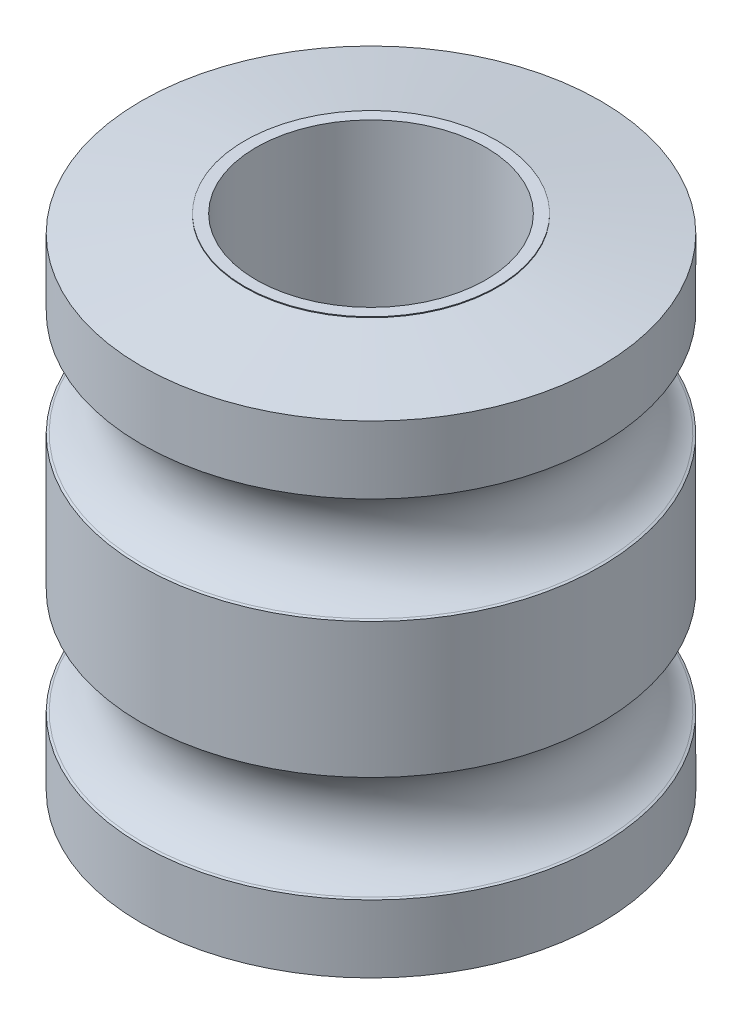
ISO-10303-21;
HEADER;
FILE_DESCRIPTION(('STEP AP214'),'2;1');
FILE_NAME('part.step','',(''),(''),'','','');
FILE_SCHEMA(('AUTOMOTIVE_DESIGN { 1 0 10303 214 1 1 1 1 }'));
ENDSEC;
DATA;
#1=APPLICATION_CONTEXT('core data for automotive mechanical design processes');
#2=APPLICATION_PROTOCOL_DEFINITION('international standard','automotive_design',2000,#1);
#3=PRODUCT_CONTEXT('',#1,'mechanical');
#4=PRODUCT('Part','Part','',(#3));
#5=PRODUCT_RELATED_PRODUCT_CATEGORY('part','',(#4));
#6=PRODUCT_DEFINITION_FORMATION('','',#4);
#7=PRODUCT_DEFINITION_CONTEXT('part definition',#1,'design');
#8=PRODUCT_DEFINITION('design','',#6,#7);
#9=PRODUCT_DEFINITION_SHAPE('','',#8);
#10=(LENGTH_UNIT() NAMED_UNIT(*) SI_UNIT(.MILLI.,.METRE.));
#11=(NAMED_UNIT(*) PLANE_ANGLE_UNIT() SI_UNIT($,.RADIAN.));
#12=(NAMED_UNIT(*) SI_UNIT($,.STERADIAN.) SOLID_ANGLE_UNIT());
#13=UNCERTAINTY_MEASURE_WITH_UNIT(LENGTH_MEASURE(1.E-05),#10,'distance_accuracy_value','');
#14=(GEOMETRIC_REPRESENTATION_CONTEXT(3) GLOBAL_UNCERTAINTY_ASSIGNED_CONTEXT((#13)) GLOBAL_UNIT_ASSIGNED_CONTEXT((#10,
#11,#12)) REPRESENTATION_CONTEXT('',''));
#15=CARTESIAN_POINT('',(0.,0.,0.));
#16=DIRECTION('',(0.,0.,1.));
#17=DIRECTION('',(1.,0.,0.));
#18=AXIS2_PLACEMENT_3D('',#15,#16,#17);
#19=CARTESIAN_POINT('',(0.,2.667,0.));
#20=DIRECTION('',(0.,-1.,0.));
#21=DIRECTION('',(0.,0.,-1.));
#22=AXIS2_PLACEMENT_3D('',#19,#20,#21);
#23=CYLINDRICAL_SURFACE('',#22,5.08);
#24=CARTESIAN_POINT('',(0.,1.17257723719656,0.));
#25=DIRECTION('',(0.,1.,0.));
#26=DIRECTION('',(0.,0.,1.));
#27=AXIS2_PLACEMENT_3D('',#24,#25,#26);
#28=CIRCLE('',#27,5.08);
#29=CARTESIAN_POINT('',(0.,1.17257723719656,5.08));
#30=VERTEX_POINT('',#29);
#31=EDGE_CURVE('E56',#30,#30,#28,.T.);
#32=ORIENTED_EDGE('',*,*,#31,.T.);
#33=EDGE_LOOP('',(#32));
#34=FACE_BOUND('',#33,.T.);
#35=CARTESIAN_POINT('',(0.,2.667,0.));
#36=DIRECTION('',(0.,1.,0.));
#37=DIRECTION('',(0.,0.,1.));
#38=AXIS2_PLACEMENT_3D('',#35,#36,#37);
#39=CIRCLE('',#38,5.08);
#40=CARTESIAN_POINT('',(0.,2.667,5.08));
#41=VERTEX_POINT('',#40);
#42=EDGE_CURVE('E59',#41,#41,#39,.T.);
#43=ORIENTED_EDGE('',*,*,#42,.F.);
#44=EDGE_LOOP('',(#43));
#45=FACE_BOUND('',#44,.T.);
#46=ADVANCED_FACE('F33',(#34,#45),#23,.T.);
#47=CARTESIAN_POINT('',(0.,2.667,0.));
#48=DIRECTION('',(0.,-1.,0.));
#49=DIRECTION('',(0.,0.,-1.));
#50=AXIS2_PLACEMENT_3D('',#47,#48,#49);
#51=CYLINDRICAL_SURFACE('',#50,2.54);
#52=CARTESIAN_POINT('',(0.,3.048,0.));
#53=DIRECTION('',(0.,1.,0.));
#54=DIRECTION('',(0.,0.,1.));
#55=AXIS2_PLACEMENT_3D('',#52,#53,#54);
#56=CIRCLE('',#55,2.54);
#57=CARTESIAN_POINT('',(0.,3.048,2.54));
#58=VERTEX_POINT('',#57);
#59=EDGE_CURVE('E68',#58,#58,#56,.T.);
#60=ORIENTED_EDGE('',*,*,#59,.T.);
#61=EDGE_LOOP('',(#60));
#62=FACE_BOUND('',#61,.T.);
#63=CARTESIAN_POINT('',(0.,-8.382,0.));
#64=DIRECTION('',(0.,1.,0.));
#65=DIRECTION('',(0.,0.,1.));
#66=AXIS2_PLACEMENT_3D('',#63,#64,#65);
#67=CIRCLE('',#66,2.54);
#68=CARTESIAN_POINT('',(0.,-8.382,2.54));
#69=VERTEX_POINT('',#68);
#70=EDGE_CURVE('E86',#69,#69,#67,.T.);
#71=ORIENTED_EDGE('',*,*,#70,.F.);
#72=EDGE_LOOP('',(#71));
#73=FACE_BOUND('',#72,.T.);
#74=ADVANCED_FACE('F92',(#62,#73),#51,.F.);
#75=CARTESIAN_POINT('',(0.,1.17257723719656,0.));
#76=DIRECTION('',(0.,1.,0.));
#77=DIRECTION('',(0.,0.,1.));
#78=AXIS2_PLACEMENT_3D('',#75,#76,#77);
#79=CONICAL_SURFACE('',#78,5.08,1.13446401379632);
#80=CARTESIAN_POINT('',(0.,1.15101088953654,0.));
#81=DIRECTION('',(0.,1.,0.));
#82=DIRECTION('',(0.,0.,1.));
#83=AXIS2_PLACEMENT_3D('',#80,#81,#82);
#84=CIRCLE('',#83,5.03375081819298);
#85=CARTESIAN_POINT('',(0.,1.15101088953654,5.03375081819298));
#86=VERTEX_POINT('',#85);
#87=EDGE_CURVE('E10',#86,#86,#84,.T.);
#88=ORIENTED_EDGE('',*,*,#87,.T.);
#89=EDGE_LOOP('',(#88));
#90=FACE_BOUND('',#89,.T.);
#91=ORIENTED_EDGE('',*,*,#31,.F.);
#92=EDGE_LOOP('',(#91));
#93=FACE_BOUND('',#92,.T.);
#94=ADVANCED_FACE('F94',(#90,#93),#79,.T.);
#95=CARTESIAN_POINT('',(0.,-2.667,0.));
#96=DIRECTION('',(0.,1.,0.));
#97=DIRECTION('',(0.,0.,-1.));
#98=AXIS2_PLACEMENT_3D('',#95,#96,#97);
#99=CYLINDRICAL_SURFACE('',#98,5.08);
#100=CARTESIAN_POINT('',(0.,-1.17257723719656,0.));
#101=DIRECTION('',(0.,1.,0.));
#102=DIRECTION('',(0.,0.,1.));
#103=AXIS2_PLACEMENT_3D('',#100,#101,#102);
#104=CIRCLE('',#103,5.08);
#105=CARTESIAN_POINT('',(0.,-1.17257723719656,5.08));
#106=VERTEX_POINT('',#105);
#107=EDGE_CURVE('E62',#106,#106,#104,.T.);
#108=ORIENTED_EDGE('',*,*,#107,.F.);
#109=EDGE_LOOP('',(#108));
#110=FACE_BOUND('',#109,.T.);
#111=CARTESIAN_POINT('',(0.,-4.16142276280344,0.));
#112=DIRECTION('',(0.,1.,0.));
#113=DIRECTION('',(0.,0.,1.));
#114=AXIS2_PLACEMENT_3D('',#111,#112,#113);
#115=CIRCLE('',#114,5.08);
#116=CARTESIAN_POINT('',(0.,-4.16142276280344,5.08));
#117=VERTEX_POINT('',#116);
#118=EDGE_CURVE('E80',#117,#117,#115,.T.);
#119=ORIENTED_EDGE('',*,*,#118,.T.);
#120=EDGE_LOOP('',(#119));
#121=FACE_BOUND('',#120,.T.);
#122=ADVANCED_FACE('F101',(#110,#121),#99,.T.);
#123=CARTESIAN_POINT('',(0.,-1.17257723719656,0.));
#124=DIRECTION('',(0.,-1.,0.));
#125=DIRECTION('',(0.,0.,1.));
#126=AXIS2_PLACEMENT_3D('',#123,#124,#125);
#127=CONICAL_SURFACE('',#126,5.08,1.13446401379632);
#128=CARTESIAN_POINT('',(0.,-1.15101088953654,0.));
#129=DIRECTION('',(0.,-1.,0.));
#130=DIRECTION('',(0.,0.,-1.));
#131=AXIS2_PLACEMENT_3D('',#128,#129,#130);
#132=CIRCLE('',#131,5.03375081819298);
#133=CARTESIAN_POINT('',(0.,-1.15101088953654,-5.03375081819298));
#134=VERTEX_POINT('',#133);
#135=EDGE_CURVE('E40',#134,#134,#132,.T.);
#136=ORIENTED_EDGE('',*,*,#135,.T.);
#137=EDGE_LOOP('',(#136));
#138=FACE_BOUND('',#137,.T.);
#139=ORIENTED_EDGE('',*,*,#107,.T.);
#140=EDGE_LOOP('',(#139));
#141=FACE_BOUND('',#140,.T.);
#142=ADVANCED_FACE('F106',(#138,#141),#127,.T.);
#143=CARTESIAN_POINT('',(0.,3.048,0.));
#144=DIRECTION('',(0.,1.,0.));
#145=DIRECTION('',(0.,0.,1.));
#146=AXIS2_PLACEMENT_3D('',#143,#144,#145);
#147=PLANE('',#146);
#148=CARTESIAN_POINT('',(0.,3.048,0.));
#149=DIRECTION('',(0.,1.,0.));
#150=DIRECTION('',(0.,0.,1.));
#151=AXIS2_PLACEMENT_3D('',#148,#149,#150);
#152=CIRCLE('',#151,2.794);
#153=CARTESIAN_POINT('',(0.,3.048,-2.794));
#154=VERTEX_POINT('',#153);
#155=EDGE_CURVE('E65',#154,#154,#152,.T.);
#156=ORIENTED_EDGE('',*,*,#155,.T.);
#157=EDGE_LOOP('',(#156));
#158=FACE_BOUND('',#157,.T.);
#159=ORIENTED_EDGE('',*,*,#59,.F.);
#160=EDGE_LOOP('',(#159));
#161=FACE_BOUND('',#160,.T.);
#162=ADVANCED_FACE('F157',(#158,#161),#147,.T.);
#163=CARTESIAN_POINT('',(0.,3.048,0.));
#164=DIRECTION('',(0.,-1.,0.));
#165=DIRECTION('',(0.,0.,-1.));
#166=AXIS2_PLACEMENT_3D('',#163,#164,#165);
#167=CYLINDRICAL_SURFACE('',#166,2.794);
#168=CARTESIAN_POINT('',(0.,3.02906683058189,0.));
#169=DIRECTION('',(0.,1.,0.));
#170=DIRECTION('',(0.,0.,1.));
#171=AXIS2_PLACEMENT_3D('',#168,#169,#170);
#172=CIRCLE('',#171,2.794);
#173=CARTESIAN_POINT('',(0.,3.02906683058189,-2.794));
#174=VERTEX_POINT('',#173);
#175=EDGE_CURVE('E53',#174,#174,#172,.T.);
#176=CARTESIAN_POINT('',(0.,3.02906683058189,-2.794));
#177=CARTESIAN_POINT('',(0.,3.02926405109667,-2.794));
#178=CARTESIAN_POINT('',(0.,3.02946127161144,-2.794));
#179=CARTESIAN_POINT('',(0.,3.02985571264098,-2.794));
#180=CARTESIAN_POINT('',(0.,3.03005293315575,-2.794));
#181=CARTESIAN_POINT('',(0.,3.0304473741853,-2.794));
#182=CARTESIAN_POINT('',(0.,3.03064459470007,-2.794));
#183=CARTESIAN_POINT('',(0.,3.03103903572961,-2.794));
#184=CARTESIAN_POINT('',(0.,3.03123625624438,-2.794));
#185=CARTESIAN_POINT('',(0.,3.03163069727393,-2.794));
#186=CARTESIAN_POINT('',(0.,3.0318279177887,-2.794));
#187=CARTESIAN_POINT('',(0.,3.03222235881824,-2.794));
#188=CARTESIAN_POINT('',(0.,3.03241957933302,-2.794));
#189=CARTESIAN_POINT('',(0.,3.03281402036256,-2.794));
#190=CARTESIAN_POINT('',(0.,3.03301124087733,-2.794));
#191=CARTESIAN_POINT('',(0.,3.03340568190688,-2.794));
#192=CARTESIAN_POINT('',(0.,3.03360290242165,-2.794));
#193=CARTESIAN_POINT('',(0.,3.03399734345119,-2.794));
#194=CARTESIAN_POINT('',(0.,3.03419456396596,-2.794));
#195=CARTESIAN_POINT('',(0.,3.03458900499551,-2.794));
#196=CARTESIAN_POINT('',(0.,3.03478622551028,-2.794));
#197=CARTESIAN_POINT('',(0.,3.03518066653982,-2.794));
#198=CARTESIAN_POINT('',(0.,3.0353778870546,-2.794));
#199=CARTESIAN_POINT('',(0.,3.03577232808414,-2.794));
#200=CARTESIAN_POINT('',(0.,3.03596954859891,-2.794));
#201=CARTESIAN_POINT('',(0.,3.03636398962845,-2.794));
#202=CARTESIAN_POINT('',(0.,3.03656121014323,-2.794));
#203=CARTESIAN_POINT('',(0.,3.03695565117277,-2.794));
#204=CARTESIAN_POINT('',(0.,3.03715287168754,-2.794));
#205=CARTESIAN_POINT('',(0.,3.03754731271709,-2.794));
#206=CARTESIAN_POINT('',(0.,3.03774453323186,-2.794));
#207=CARTESIAN_POINT('',(0.,3.0381389742614,-2.794));
#208=CARTESIAN_POINT('',(0.,3.03833619477617,-2.794));
#209=CARTESIAN_POINT('',(0.,3.03873063580572,-2.794));
#210=CARTESIAN_POINT('',(0.,3.03892785632049,-2.794));
#211=CARTESIAN_POINT('',(0.,3.03932229735003,-2.794));
#212=CARTESIAN_POINT('',(0.,3.03951951786481,-2.794));
#213=CARTESIAN_POINT('',(0.,3.03991395889435,-2.794));
#214=CARTESIAN_POINT('',(0.,3.04011117940912,-2.794));
#215=CARTESIAN_POINT('',(0.,3.04050562043867,-2.794));
#216=CARTESIAN_POINT('',(0.,3.04070284095344,-2.794));
#217=CARTESIAN_POINT('',(0.,3.04109728198298,-2.794));
#218=CARTESIAN_POINT('',(0.,3.04129450249775,-2.794));
#219=CARTESIAN_POINT('',(0.,3.0416889435273,-2.794));
#220=CARTESIAN_POINT('',(0.,3.04188616404207,-2.794));
#221=CARTESIAN_POINT('',(0.,3.04228060507161,-2.794));
#222=CARTESIAN_POINT('',(0.,3.04247782558638,-2.794));
#223=CARTESIAN_POINT('',(0.,3.04287226661593,-2.794));
#224=CARTESIAN_POINT('',(0.,3.0430694871307,-2.794));
#225=CARTESIAN_POINT('',(0.,3.04346392816024,-2.794));
#226=CARTESIAN_POINT('',(0.,3.04366114867502,-2.794));
#227=CARTESIAN_POINT('',(0.,3.04405558970456,-2.794));
#228=CARTESIAN_POINT('',(0.,3.04425281021933,-2.794));
#229=CARTESIAN_POINT('',(0.,3.04464725124888,-2.794));
#230=CARTESIAN_POINT('',(0.,3.04484447176365,-2.794));
#231=CARTESIAN_POINT('',(0.,3.04523891279319,-2.794));
#232=CARTESIAN_POINT('',(0.,3.04543613330796,-2.794));
#233=CARTESIAN_POINT('',(0.,3.04583057433751,-2.794));
#234=CARTESIAN_POINT('',(0.,3.04602779485228,-2.794));
#235=CARTESIAN_POINT('',(0.,3.04642223588182,-2.794));
#236=CARTESIAN_POINT('',(0.,3.0466194563966,-2.794));
#237=CARTESIAN_POINT('',(0.,3.04701389742614,-2.794));
#238=CARTESIAN_POINT('',(0.,3.04721111794091,-2.794));
#239=CARTESIAN_POINT('',(0.,3.04760555897046,-2.794));
#240=CARTESIAN_POINT('',(0.,3.04780277948523,-2.794));
#241=CARTESIAN_POINT('',(0.,3.048,-2.794));
#242=B_SPLINE_CURVE_WITH_KNOTS('',3,(#176,#177,#178,#179,#180,#181,#182,#183,#184,#185,#186,
#187,#188,#189,#190,#191,#192,#193,#194,#195,#196,#197,#198,#199,#200,#201,#202,#203,#204,#205,
#206,#207,#208,#209,#210,#211,#212,#213,#214,#215,#216,#217,#218,#219,#220,#221,#222,#223,#224,
#225,#226,#227,#228,#229,#230,#231,#232,#233,#234,#235,#236,#237,#238,#239,#240,#241),
.UNSPECIFIED.,.F.,.F.,(4,2,2,2,2,2,2,2,2,2,2,2,2,2,2,2,2,2,2,2,2,2,2,2,2,2,2,2,2,2,2,2,4),(0.,
0.000591661544315728,0.00118332308863146,0.00177498463294718,0.00236664617726291,
0.00295830772157907,0.0035499692658948,0.00414163081021053,0.00473329235452626,
0.00532495389884199,0.00591661544315815,0.00650827698747388,0.00709993853178961,
0.00769160007610533,0.0082832616204215,0.00887492316473722,0.00946658470905295,
0.0100582462533687,0.0106499077976844,0.0112415693420006,0.0118332308863163,0.012424892430632,
0.0130165539749478,0.0136082155192639,0.0141998770635796,0.0147915386078954,0.0153832001522111,
0.0159748616965268,0.016566523240843,0.0171581847851587,0.0177498463294744,0.0183415078737902,
0.0189331694181063),.UNSPECIFIED.);
#243=EDGE_CURVE('BSEAM112',#174,#154,#242,.T.);
#244=ORIENTED_EDGE('',*,*,#175,.T.);
#245=ORIENTED_EDGE('',*,*,#155,.F.);
#246=ORIENTED_EDGE('',*,*,#243,.T.);
#247=ORIENTED_EDGE('',*,*,#243,.F.);
#248=EDGE_LOOP('',(#244,#246,#245,#247));
#249=FACE_BOUND('',#248,.T.);
#250=ADVANCED_FACE('F112',(#249),#167,.T.);
#251=CARTESIAN_POINT('',(0.,3.02906683058189,0.));
#252=DIRECTION('',(0.,-1.,0.));
#253=DIRECTION('',(0.,0.,-1.));
#254=AXIS2_PLACEMENT_3D('',#251,#252,#253);
#255=CONICAL_SURFACE('',#254,2.794,1.4137166941154);
#256=ORIENTED_EDGE('',*,*,#42,.T.);
#257=EDGE_LOOP('',(#256));
#258=FACE_BOUND('',#257,.T.);
#259=ORIENTED_EDGE('',*,*,#175,.F.);
#260=EDGE_LOOP('',(#259));
#261=FACE_BOUND('',#260,.T.);
#262=ADVANCED_FACE('F109',(#258,#261),#255,.T.);
#263=CARTESIAN_POINT('',(0.,-8.001,0.));
#264=DIRECTION('',(0.,1.,0.));
#265=DIRECTION('',(0.,0.,-1.));
#266=AXIS2_PLACEMENT_3D('',#263,#264,#265);
#267=CYLINDRICAL_SURFACE('',#266,5.08);
#268=CARTESIAN_POINT('',(0.,-6.50657723719656,0.));
#269=DIRECTION('',(0.,1.,0.));
#270=DIRECTION('',(0.,0.,1.));
#271=AXIS2_PLACEMENT_3D('',#268,#269,#270);
#272=CIRCLE('',#271,5.08);
#273=CARTESIAN_POINT('',(0.,-6.50657723719656,5.08));
#274=VERTEX_POINT('',#273);
#275=EDGE_CURVE('E74',#274,#274,#272,.T.);
#276=ORIENTED_EDGE('',*,*,#275,.F.);
#277=EDGE_LOOP('',(#276));
#278=FACE_BOUND('',#277,.T.);
#279=CARTESIAN_POINT('',(0.,-8.001,0.));
#280=DIRECTION('',(0.,1.,0.));
#281=DIRECTION('',(0.,0.,1.));
#282=AXIS2_PLACEMENT_3D('',#279,#280,#281);
#283=CIRCLE('',#282,5.08);
#284=CARTESIAN_POINT('',(0.,-8.001,5.08));
#285=VERTEX_POINT('',#284);
#286=EDGE_CURVE('E77',#285,#285,#283,.T.);
#287=ORIENTED_EDGE('',*,*,#286,.T.);
#288=EDGE_LOOP('',(#287));
#289=FACE_BOUND('',#288,.T.);
#290=ADVANCED_FACE('F111',(#278,#289),#267,.T.);
#291=CARTESIAN_POINT('',(0.,-6.50657723719656,0.));
#292=DIRECTION('',(0.,-1.,0.));
#293=DIRECTION('',(0.,0.,1.));
#294=AXIS2_PLACEMENT_3D('',#291,#292,#293);
#295=CONICAL_SURFACE('',#294,5.08,1.13446401379632);
#296=CARTESIAN_POINT('',(0.,-6.48501088953654,0.));
#297=DIRECTION('',(0.,-1.,0.));
#298=DIRECTION('',(0.,0.,-1.));
#299=AXIS2_PLACEMENT_3D('',#296,#297,#298);
#300=CIRCLE('',#299,5.03375081819298);
#301=CARTESIAN_POINT('',(0.,-6.48501088953654,-5.03375081819298));
#302=VERTEX_POINT('',#301);
#303=EDGE_CURVE('E48',#302,#302,#300,.T.);
#304=ORIENTED_EDGE('',*,*,#303,.T.);
#305=EDGE_LOOP('',(#304));
#306=FACE_BOUND('',#305,.T.);
#307=ORIENTED_EDGE('',*,*,#275,.T.);
#308=EDGE_LOOP('',(#307));
#309=FACE_BOUND('',#308,.T.);
#310=ADVANCED_FACE('F130',(#306,#309),#295,.T.);
#311=CARTESIAN_POINT('',(0.,-4.16142276280344,0.));
#312=DIRECTION('',(0.,1.,0.));
#313=DIRECTION('',(0.,0.,1.));
#314=AXIS2_PLACEMENT_3D('',#311,#312,#313);
#315=CONICAL_SURFACE('',#314,5.08,1.13446401379632);
#316=CARTESIAN_POINT('',(0.,-4.18298911046345,0.));
#317=DIRECTION('',(0.,1.,0.));
#318=DIRECTION('',(0.,0.,1.));
#319=AXIS2_PLACEMENT_3D('',#316,#317,#318);
#320=CIRCLE('',#319,5.03375081819298);
#321=CARTESIAN_POINT('',(0.,-4.18298911046345,5.03375081819298));
#322=VERTEX_POINT('',#321);
#323=EDGE_CURVE('E44',#322,#322,#320,.T.);
#324=ORIENTED_EDGE('',*,*,#323,.T.);
#325=EDGE_LOOP('',(#324));
#326=FACE_BOUND('',#325,.T.);
#327=ORIENTED_EDGE('',*,*,#118,.F.);
#328=EDGE_LOOP('',(#327));
#329=FACE_BOUND('',#328,.T.);
#330=ADVANCED_FACE('F133',(#326,#329),#315,.T.);
#331=CARTESIAN_POINT('',(0.,-8.382,0.));
#332=DIRECTION('',(0.,-1.,0.));
#333=DIRECTION('',(0.,0.,1.));
#334=AXIS2_PLACEMENT_3D('',#331,#332,#333);
#335=PLANE('',#334);
#336=CARTESIAN_POINT('',(0.,-8.382,0.));
#337=DIRECTION('',(0.,1.,0.));
#338=DIRECTION('',(0.,0.,1.));
#339=AXIS2_PLACEMENT_3D('',#336,#337,#338);
#340=CIRCLE('',#339,2.794);
#341=CARTESIAN_POINT('',(0.,-8.382,-2.794));
#342=VERTEX_POINT('',#341);
#343=EDGE_CURVE('E83',#342,#342,#340,.T.);
#344=ORIENTED_EDGE('',*,*,#343,.F.);
#345=EDGE_LOOP('',(#344));
#346=FACE_BOUND('',#345,.T.);
#347=ORIENTED_EDGE('',*,*,#70,.T.);
#348=EDGE_LOOP('',(#347));
#349=FACE_BOUND('',#348,.T.);
#350=ADVANCED_FACE('F90',(#346,#349),#335,.T.);
#351=CARTESIAN_POINT('',(0.,-8.382,0.));
#352=DIRECTION('',(0.,1.,0.));
#353=DIRECTION('',(0.,0.,-1.));
#354=AXIS2_PLACEMENT_3D('',#351,#352,#353);
#355=CYLINDRICAL_SURFACE('',#354,2.794);
#356=CARTESIAN_POINT('',(0.,-8.36306683058189,0.));
#357=DIRECTION('',(0.,1.,0.));
#358=DIRECTION('',(0.,0.,1.));
#359=AXIS2_PLACEMENT_3D('',#356,#357,#358);
#360=CIRCLE('',#359,2.794);
#361=CARTESIAN_POINT('',(0.,-8.36306683058189,-2.794));
#362=VERTEX_POINT('',#361);
#363=EDGE_CURVE('E71',#362,#362,#360,.T.);
#364=CARTESIAN_POINT('',(0.,-8.36306683058189,-2.794));
#365=CARTESIAN_POINT('',(0.,-8.36326405109666,-2.794));
#366=CARTESIAN_POINT('',(0.,-8.36346127161144,-2.794));
#367=CARTESIAN_POINT('',(0.,-8.36385571264098,-2.794));
#368=CARTESIAN_POINT('',(0.,-8.36405293315575,-2.794));
#369=CARTESIAN_POINT('',(0.,-8.3644473741853,-2.794));
#370=CARTESIAN_POINT('',(0.,-8.36464459470007,-2.794));
#371=CARTESIAN_POINT('',(0.,-8.36503903572961,-2.794));
#372=CARTESIAN_POINT('',(0.,-8.36523625624439,-2.794));
#373=CARTESIAN_POINT('',(0.,-8.36563069727393,-2.794));
#374=CARTESIAN_POINT('',(0.,-8.3658279177887,-2.794));
#375=CARTESIAN_POINT('',(0.,-8.36622235881824,-2.794));
#376=CARTESIAN_POINT('',(0.,-8.36641957933302,-2.794));
#377=CARTESIAN_POINT('',(0.,-8.36681402036256,-2.794));
#378=CARTESIAN_POINT('',(0.,-8.36701124087733,-2.794));
#379=CARTESIAN_POINT('',(0.,-8.36740568190688,-2.794));
#380=CARTESIAN_POINT('',(0.,-8.36760290242165,-2.794));
#381=CARTESIAN_POINT('',(0.,-8.36799734345119,-2.794));
#382=CARTESIAN_POINT('',(0.,-8.36819456396596,-2.794));
#383=CARTESIAN_POINT('',(0.,-8.36858900499551,-2.794));
#384=CARTESIAN_POINT('',(0.,-8.36878622551028,-2.794));
#385=CARTESIAN_POINT('',(0.,-8.36918066653982,-2.794));
#386=CARTESIAN_POINT('',(0.,-8.3693778870546,-2.794));
#387=CARTESIAN_POINT('',(0.,-8.36977232808414,-2.794));
#388=CARTESIAN_POINT('',(0.,-8.36996954859891,-2.794));
#389=CARTESIAN_POINT('',(0.,-8.37036398962845,-2.794));
#390=CARTESIAN_POINT('',(0.,-8.37056121014323,-2.794));
#391=CARTESIAN_POINT('',(0.,-8.37095565117277,-2.794));
#392=CARTESIAN_POINT('',(0.,-8.37115287168754,-2.794));
#393=CARTESIAN_POINT('',(0.,-8.37154731271709,-2.794));
#394=CARTESIAN_POINT('',(0.,-8.37174453323186,-2.794));
#395=CARTESIAN_POINT('',(0.,-8.3721389742614,-2.794));
#396=CARTESIAN_POINT('',(0.,-8.37233619477617,-2.794));
#397=CARTESIAN_POINT('',(0.,-8.37273063580572,-2.794));
#398=CARTESIAN_POINT('',(0.,-8.37292785632049,-2.794));
#399=CARTESIAN_POINT('',(0.,-8.37332229735003,-2.794));
#400=CARTESIAN_POINT('',(0.,-8.37351951786481,-2.794));
#401=CARTESIAN_POINT('',(0.,-8.37391395889435,-2.794));
#402=CARTESIAN_POINT('',(0.,-8.37411117940912,-2.794));
#403=CARTESIAN_POINT('',(0.,-8.37450562043866,-2.794));
#404=CARTESIAN_POINT('',(0.,-8.37470284095344,-2.794));
#405=CARTESIAN_POINT('',(0.,-8.37509728198298,-2.794));
#406=CARTESIAN_POINT('',(0.,-8.37529450249775,-2.794));
#407=CARTESIAN_POINT('',(0.,-8.3756889435273,-2.794));
#408=CARTESIAN_POINT('',(0.,-8.37588616404207,-2.794));
#409=CARTESIAN_POINT('',(0.,-8.37628060507161,-2.794));
#410=CARTESIAN_POINT('',(0.,-8.37647782558639,-2.794));
#411=CARTESIAN_POINT('',(0.,-8.37687226661593,-2.794));
#412=CARTESIAN_POINT('',(0.,-8.3770694871307,-2.794));
#413=CARTESIAN_POINT('',(0.,-8.37746392816024,-2.794));
#414=CARTESIAN_POINT('',(0.,-8.37766114867502,-2.794));
#415=CARTESIAN_POINT('',(0.,-8.37805558970456,-2.794));
#416=CARTESIAN_POINT('',(0.,-8.37825281021933,-2.794));
#417=CARTESIAN_POINT('',(0.,-8.37864725124888,-2.794));
#418=CARTESIAN_POINT('',(0.,-8.37884447176365,-2.794));
#419=CARTESIAN_POINT('',(0.,-8.37923891279319,-2.794));
#420=CARTESIAN_POINT('',(0.,-8.37943613330796,-2.794));
#421=CARTESIAN_POINT('',(0.,-8.37983057433751,-2.794));
#422=CARTESIAN_POINT('',(0.,-8.38002779485228,-2.794));
#423=CARTESIAN_POINT('',(0.,-8.38042223588183,-2.794));
#424=CARTESIAN_POINT('',(0.,-8.3806194563966,-2.794));
#425=CARTESIAN_POINT('',(0.,-8.38101389742614,-2.794));
#426=CARTESIAN_POINT('',(0.,-8.38121111794091,-2.794));
#427=CARTESIAN_POINT('',(0.,-8.38160555897046,-2.794));
#428=CARTESIAN_POINT('',(0.,-8.38180277948523,-2.794));
#429=CARTESIAN_POINT('',(0.,-8.382,-2.794));
#430=B_SPLINE_CURVE_WITH_KNOTS('',3,(#364,#365,#366,#367,#368,#369,#370,#371,#372,#373,#374,
#375,#376,#377,#378,#379,#380,#381,#382,#383,#384,#385,#386,#387,#388,#389,#390,#391,#392,#393,
#394,#395,#396,#397,#398,#399,#400,#401,#402,#403,#404,#405,#406,#407,#408,#409,#410,#411,#412,
#413,#414,#415,#416,#417,#418,#419,#420,#421,#422,#423,#424,#425,#426,#427,#428,#429),
.UNSPECIFIED.,.F.,.F.,(4,2,2,2,2,2,2,2,2,2,2,2,2,2,2,2,2,2,2,2,2,2,2,2,2,2,2,2,2,2,2,2,4),(0.,
0.000591661544317029,0.00118332308863232,0.00177498463294762,0.00236664617726465,
0.00295830772157994,0.00354996926589524,0.00414163081021227,0.00473329235452756,
0.00532495389884285,0.00591661544315988,0.00650827698747518,0.00709993853179047,
0.0076916000761075,0.0082832616204228,0.00887492316473809,0.00946658470905339,
0.0100582462533704,0.0106499077976857,0.011241569342001,0.011833230886318,0.0124248924306333,
0.0130165539749486,0.0136082155192657,0.0141998770635809,0.0147915386078962,0.0153832001522133,
0.0159748616965286,0.0165665232408439,0.0171581847851609,0.0177498463294762,0.0183415078737915,
0.0189331694181068),.UNSPECIFIED.);
#431=EDGE_CURVE('BSEAM123',#362,#342,#430,.T.);
#432=ORIENTED_EDGE('',*,*,#363,.F.);
#433=ORIENTED_EDGE('',*,*,#343,.T.);
#434=ORIENTED_EDGE('',*,*,#431,.T.);
#435=ORIENTED_EDGE('',*,*,#431,.F.);
#436=EDGE_LOOP('',(#432,#434,#433,#435));
#437=FACE_BOUND('',#436,.T.);
#438=ADVANCED_FACE('F123',(#437),#355,.T.);
#439=CARTESIAN_POINT('',(0.,-8.36306683058189,0.));
#440=DIRECTION('',(0.,1.,0.));
#441=DIRECTION('',(0.,0.,-1.));
#442=AXIS2_PLACEMENT_3D('',#439,#440,#441);
#443=CONICAL_SURFACE('',#442,2.794,1.4137166941154);
#444=ORIENTED_EDGE('',*,*,#286,.F.);
#445=EDGE_LOOP('',(#444));
#446=FACE_BOUND('',#445,.T.);
#447=ORIENTED_EDGE('',*,*,#363,.T.);
#448=EDGE_LOOP('',(#447));
#449=FACE_BOUND('',#448,.T.);
#450=ADVANCED_FACE('F116',(#446,#449),#443,.T.);
#451=CARTESIAN_POINT('',(0.,-5.334,0.));
#452=DIRECTION('',(0.,-1.,0.));
#453=DIRECTION('',(0.,0.,-1.));
#454=AXIS2_PLACEMENT_3D('',#451,#452,#453);
#455=TOROIDAL_SURFACE('',#454,5.57047601060367,1.27);
#456=ORIENTED_EDGE('',*,*,#323,.F.);
#457=EDGE_LOOP('',(#456));
#458=FACE_BOUND('',#457,.T.);
#459=ORIENTED_EDGE('',*,*,#303,.F.);
#460=EDGE_LOOP('',(#459));
#461=FACE_BOUND('',#460,.T.);
#462=ADVANCED_FACE('F114',(#458,#461),#455,.F.);
#463=CARTESIAN_POINT('',(0.,0.,0.));
#464=DIRECTION('',(0.,-1.,0.));
#465=DIRECTION('',(0.,0.,-1.));
#466=AXIS2_PLACEMENT_3D('',#463,#464,#465);
#467=TOROIDAL_SURFACE('',#466,5.57047601060367,1.27);
#468=ORIENTED_EDGE('',*,*,#87,.F.);
#469=EDGE_LOOP('',(#468));
#470=FACE_BOUND('',#469,.T.);
#471=ORIENTED_EDGE('',*,*,#135,.F.);
#472=EDGE_LOOP('',(#471));
#473=FACE_BOUND('',#472,.T.);
#474=ADVANCED_FACE('F35',(#470,#473),#467,.F.);
#475=CLOSED_SHELL('',(#46,#74,#94,#122,#142,#162,#250,#262,#290,#310,#330,#350,#438,#450,#462,#474));
#476=MANIFOLD_SOLID_BREP('B2',#475);
#477=ADVANCED_BREP_SHAPE_REPRESENTATION('',(#18,#476),#14);
#478=SHAPE_DEFINITION_REPRESENTATION(#9,#477);
ENDSEC;
END-ISO-10303-21;
